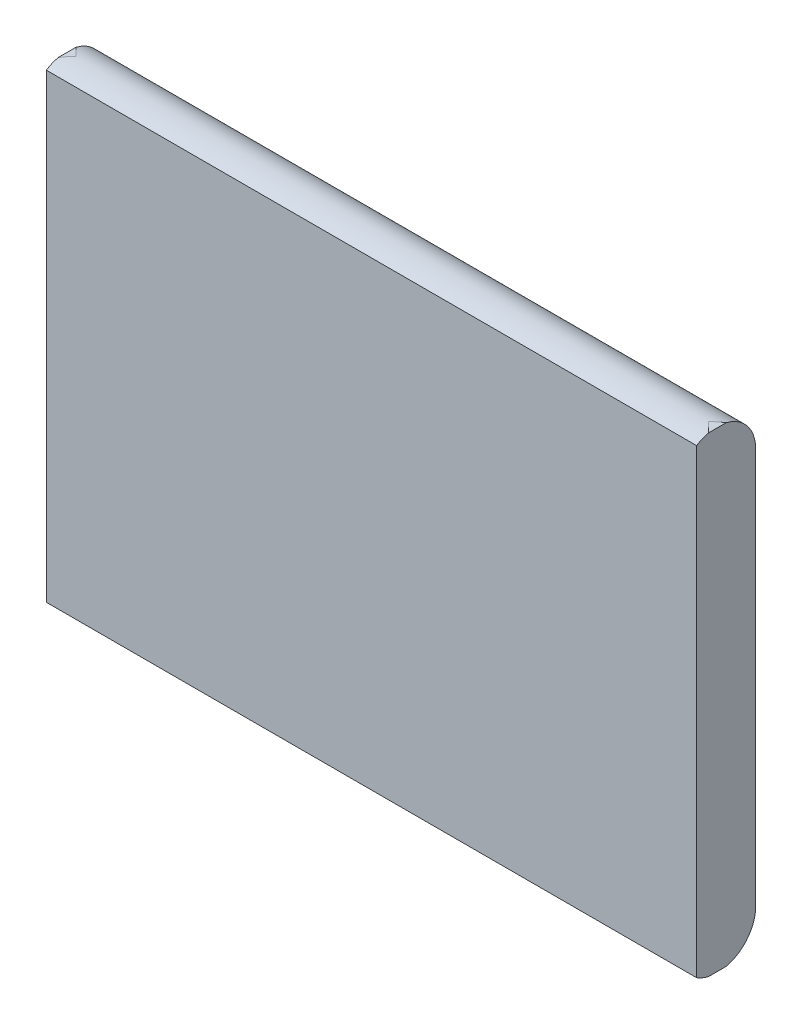
ISO-10303-21;
HEADER;
FILE_DESCRIPTION(('STEP AP214'),'2;1');
FILE_NAME('part.step','',(''),(''),'','','');
FILE_SCHEMA(('AUTOMOTIVE_DESIGN { 1 0 10303 214 1 1 1 1 }'));
ENDSEC;
DATA;
#1=APPLICATION_CONTEXT('core data for automotive mechanical design processes');
#2=APPLICATION_PROTOCOL_DEFINITION('international standard','automotive_design',2000,#1);
#3=PRODUCT_CONTEXT('',#1,'mechanical');
#4=PRODUCT('Part','Part','',(#3));
#5=PRODUCT_RELATED_PRODUCT_CATEGORY('part','',(#4));
#6=PRODUCT_DEFINITION_FORMATION('','',#4);
#7=PRODUCT_DEFINITION_CONTEXT('part definition',#1,'design');
#8=PRODUCT_DEFINITION('design','',#6,#7);
#9=PRODUCT_DEFINITION_SHAPE('','',#8);
#10=(LENGTH_UNIT() NAMED_UNIT(*) SI_UNIT(.MILLI.,.METRE.));
#11=(NAMED_UNIT(*) PLANE_ANGLE_UNIT() SI_UNIT($,.RADIAN.));
#12=(NAMED_UNIT(*) SI_UNIT($,.STERADIAN.) SOLID_ANGLE_UNIT());
#13=UNCERTAINTY_MEASURE_WITH_UNIT(LENGTH_MEASURE(1.E-05),#10,'distance_accuracy_value','');
#14=(GEOMETRIC_REPRESENTATION_CONTEXT(3) GLOBAL_UNCERTAINTY_ASSIGNED_CONTEXT((#13)) GLOBAL_UNIT_ASSIGNED_CONTEXT((#10,
#11,#12)) REPRESENTATION_CONTEXT('',''));
#15=CARTESIAN_POINT('',(0.,0.,0.));
#16=DIRECTION('',(0.,0.,1.));
#17=DIRECTION('',(1.,0.,0.));
#18=AXIS2_PLACEMENT_3D('',#15,#16,#17);
#19=CARTESIAN_POINT('',(-15.,-16.75,3.25));
#20=DIRECTION('',(1.,0.,0.));
#21=DIRECTION('',(0.,0.,-1.));
#22=AXIS2_PLACEMENT_3D('',#19,#20,#21);
#23=CYLINDRICAL_SURFACE('',#22,3.25);
#24=DIRECTION('',(1.,0.,0.));
#25=VECTOR('',#24,1.);
#26=CARTESIAN_POINT('',(-15.,-19.4886127875258,5.));
#27=LINE('',#26,#25);
#28=CARTESIAN_POINT('',(27.5,-19.4886127875258,5.));
#29=VERTEX_POINT('',#28);
#30=CARTESIAN_POINT('',(-27.5,-19.4886127875258,5.));
#31=VERTEX_POINT('',#30);
#32=EDGE_CURVE('E162',#29,#31,#27,.F.);
#33=ORIENTED_EDGE('',*,*,#32,.T.);
#34=CARTESIAN_POINT('',(-27.5,-16.75,3.25));
#35=DIRECTION('',(-1.,0.,0.));
#36=DIRECTION('',(0.,0.,1.));
#37=AXIS2_PLACEMENT_3D('',#34,#35,#36);
#38=CIRCLE('',#37,3.25);
#39=CARTESIAN_POINT('',(-27.5,-19.9122776601684,4.));
#40=VERTEX_POINT('',#39);
#41=EDGE_CURVE('E206',#31,#40,#38,.F.);
#42=ORIENTED_EDGE('',*,*,#41,.T.);
#43=CARTESIAN_POINT('',(-26.75,-16.75,3.25));
#44=DIRECTION('',(0.707106781186547,0.,0.707106781186547));
#45=DIRECTION('',(0.707106781186547,0.,-0.707106781186547));
#46=AXIS2_PLACEMENT_3D('',#43,#44,#45);
#47=ELLIPSE('',#46,4.59619407771256,3.25);
#48=CARTESIAN_POINT('',(-26.75,-20.,3.25));
#49=VERTEX_POINT('',#48);
#50=EDGE_CURVE('E155',#40,#49,#47,.T.);
#51=ORIENTED_EDGE('',*,*,#50,.T.);
#52=CARTESIAN_POINT('',(-26.75,-16.75,3.25));
#53=DIRECTION('',(0.707106781186547,0.,-0.707106781186547));
#54=DIRECTION('',(0.707106781186547,0.,0.707106781186547));
#55=AXIS2_PLACEMENT_3D('',#52,#53,#54);
#56=ELLIPSE('',#55,4.59619407771256,3.25);
#57=CARTESIAN_POINT('',(-27.5,-19.9122776601684,2.5));
#58=VERTEX_POINT('',#57);
#59=EDGE_CURVE('E151',#49,#58,#56,.T.);
#60=ORIENTED_EDGE('',*,*,#59,.T.);
#61=CARTESIAN_POINT('',(-27.5,-16.75,0.));
#62=VERTEX_POINT('',#61);
#63=EDGE_CURVE('E207',#58,#62,#38,.F.);
#64=ORIENTED_EDGE('',*,*,#63,.T.);
#65=DIRECTION('',(1.,0.,0.));
#66=VECTOR('',#65,1.);
#67=CARTESIAN_POINT('',(0.,-16.75,0.));
#68=LINE('',#67,#66);
#69=CARTESIAN_POINT('',(27.5,-16.75,0.));
#70=VERTEX_POINT('',#69);
#71=EDGE_CURVE('E133',#62,#70,#68,.T.);
#72=ORIENTED_EDGE('',*,*,#71,.T.);
#73=CARTESIAN_POINT('',(27.5,-16.75,3.25));
#74=DIRECTION('',(1.,0.,0.));
#75=DIRECTION('',(0.,0.,-1.));
#76=AXIS2_PLACEMENT_3D('',#73,#74,#75);
#77=CIRCLE('',#76,3.25);
#78=CARTESIAN_POINT('',(27.5,-19.9122776601684,2.5));
#79=VERTEX_POINT('',#78);
#80=EDGE_CURVE('E183',#70,#79,#77,.F.);
#81=ORIENTED_EDGE('',*,*,#80,.T.);
#82=CARTESIAN_POINT('',(26.75,-16.75,3.25));
#83=DIRECTION('',(0.707106781186547,0.,0.707106781186547));
#84=DIRECTION('',(0.707106781186547,0.,-0.707106781186547));
#85=AXIS2_PLACEMENT_3D('',#82,#83,#84);
#86=ELLIPSE('',#85,4.59619407771256,3.25);
#87=CARTESIAN_POINT('',(26.75,-20.,3.25));
#88=VERTEX_POINT('',#87);
#89=EDGE_CURVE('E148',#79,#88,#86,.F.);
#90=ORIENTED_EDGE('',*,*,#89,.T.);
#91=CARTESIAN_POINT('',(26.75,-16.75,3.25));
#92=DIRECTION('',(0.707106781186547,0.,-0.707106781186547));
#93=DIRECTION('',(0.707106781186547,0.,0.707106781186547));
#94=AXIS2_PLACEMENT_3D('',#91,#92,#93);
#95=ELLIPSE('',#94,4.59619407771256,3.25);
#96=CARTESIAN_POINT('',(27.5,-19.9122776601684,4.));
#97=VERTEX_POINT('',#96);
#98=EDGE_CURVE('E158',#88,#97,#95,.F.);
#99=ORIENTED_EDGE('',*,*,#98,.T.);
#100=EDGE_CURVE('E174',#97,#29,#77,.F.);
#101=ORIENTED_EDGE('',*,*,#100,.T.);
#102=EDGE_LOOP('',(#33,#42,#51,#60,#64,#72,#81,#90,#99,#101));
#103=FACE_BOUND('',#102,.T.);
#104=ADVANCED_FACE('F38',(#103),#23,.T.);
#105=CARTESIAN_POINT('',(15.,16.75,3.25));
#106=DIRECTION('',(-1.,0.,0.));
#107=DIRECTION('',(0.,0.,1.));
#108=AXIS2_PLACEMENT_3D('',#105,#106,#107);
#109=CYLINDRICAL_SURFACE('',#108,3.25);
#110=DIRECTION('',(1.,0.,0.));
#111=VECTOR('',#110,1.);
#112=CARTESIAN_POINT('',(0.,16.75,0.));
#113=LINE('',#112,#111);
#114=CARTESIAN_POINT('',(27.5,16.75,0.));
#115=VERTEX_POINT('',#114);
#116=CARTESIAN_POINT('',(-27.5,16.75,0.));
#117=VERTEX_POINT('',#116);
#118=EDGE_CURVE('E126',#115,#117,#113,.F.);
#119=ORIENTED_EDGE('',*,*,#118,.T.);
#120=CARTESIAN_POINT('',(-27.5,16.75,3.25));
#121=DIRECTION('',(-1.,0.,0.));
#122=DIRECTION('',(0.,0.,1.));
#123=AXIS2_PLACEMENT_3D('',#120,#121,#122);
#124=CIRCLE('',#123,3.25);
#125=CARTESIAN_POINT('',(-27.5,19.9122776601684,2.5));
#126=VERTEX_POINT('',#125);
#127=EDGE_CURVE('E115',#117,#126,#124,.F.);
#128=ORIENTED_EDGE('',*,*,#127,.T.);
#129=CARTESIAN_POINT('',(-26.75,16.75,3.25));
#130=DIRECTION('',(-0.707106781186547,0.,0.707106781186547));
#131=DIRECTION('',(-0.707106781186547,0.,-0.707106781186547));
#132=AXIS2_PLACEMENT_3D('',#129,#130,#131);
#133=ELLIPSE('',#132,4.59619407771256,3.25);
#134=CARTESIAN_POINT('',(-26.75,20.,3.25));
#135=VERTEX_POINT('',#134);
#136=EDGE_CURVE('E123',#126,#135,#133,.F.);
#137=ORIENTED_EDGE('',*,*,#136,.T.);
#138=CARTESIAN_POINT('',(-26.75,16.75,3.25));
#139=DIRECTION('',(-0.707106781186547,0.,-0.707106781186547));
#140=DIRECTION('',(-0.707106781186547,0.,0.707106781186547));
#141=AXIS2_PLACEMENT_3D('',#138,#139,#140);
#142=ELLIPSE('',#141,4.59619407771256,3.25);
#143=CARTESIAN_POINT('',(-27.5,19.9122776601684,4.));
#144=VERTEX_POINT('',#143);
#145=EDGE_CURVE('E131',#135,#144,#142,.F.);
#146=ORIENTED_EDGE('',*,*,#145,.T.);
#147=CARTESIAN_POINT('',(-27.5,19.4886127875258,5.));
#148=VERTEX_POINT('',#147);
#149=EDGE_CURVE('E54',#144,#148,#124,.F.);
#150=ORIENTED_EDGE('',*,*,#149,.T.);
#151=DIRECTION('',(-1.,0.,0.));
#152=VECTOR('',#151,1.);
#153=CARTESIAN_POINT('',(15.,19.4886127875258,5.));
#154=LINE('',#153,#152);
#155=CARTESIAN_POINT('',(27.5,19.4886127875258,5.));
#156=VERTEX_POINT('',#155);
#157=EDGE_CURVE('E60',#148,#156,#154,.F.);
#158=ORIENTED_EDGE('',*,*,#157,.T.);
#159=CARTESIAN_POINT('',(27.5,16.75,3.25));
#160=DIRECTION('',(1.,0.,0.));
#161=DIRECTION('',(0.,0.,-1.));
#162=AXIS2_PLACEMENT_3D('',#159,#160,#161);
#163=CIRCLE('',#162,3.25);
#164=CARTESIAN_POINT('',(27.5,19.9122776601684,4.));
#165=VERTEX_POINT('',#164);
#166=EDGE_CURVE('E176',#156,#165,#163,.F.);
#167=ORIENTED_EDGE('',*,*,#166,.T.);
#168=CARTESIAN_POINT('',(26.75,16.75,3.25));
#169=DIRECTION('',(-0.707106781186547,0.,0.707106781186547));
#170=DIRECTION('',(-0.707106781186547,0.,-0.707106781186547));
#171=AXIS2_PLACEMENT_3D('',#168,#169,#170);
#172=ELLIPSE('',#171,4.59619407771256,3.25);
#173=CARTESIAN_POINT('',(26.75,20.,3.25));
#174=VERTEX_POINT('',#173);
#175=EDGE_CURVE('E140',#165,#174,#172,.T.);
#176=ORIENTED_EDGE('',*,*,#175,.T.);
#177=CARTESIAN_POINT('',(26.75,16.75,3.25));
#178=DIRECTION('',(-0.707106781186547,0.,-0.707106781186547));
#179=DIRECTION('',(-0.707106781186547,0.,0.707106781186547));
#180=AXIS2_PLACEMENT_3D('',#177,#178,#179);
#181=ELLIPSE('',#180,4.59619407771256,3.25);
#182=CARTESIAN_POINT('',(27.5,19.9122776601684,2.5));
#183=VERTEX_POINT('',#182);
#184=EDGE_CURVE('E134',#174,#183,#181,.T.);
#185=ORIENTED_EDGE('',*,*,#184,.T.);
#186=EDGE_CURVE('E191',#183,#115,#163,.F.);
#187=ORIENTED_EDGE('',*,*,#186,.T.);
#188=EDGE_LOOP('',(#119,#128,#137,#146,#150,#158,#167,#176,#185,#187));
#189=FACE_BOUND('',#188,.T.);
#190=ADVANCED_FACE('F122',(#189),#109,.T.);
#191=CARTESIAN_POINT('',(0.,0.,0.));
#192=DIRECTION('',(0.,0.,1.));
#193=DIRECTION('',(1.,0.,0.));
#194=AXIS2_PLACEMENT_3D('',#191,#192,#193);
#195=PLANE('',#194);
#196=DIRECTION('',(0.,-1.,0.));
#197=VECTOR('',#196,1.);
#198=CARTESIAN_POINT('',(-27.5,0.,0.));
#199=LINE('',#198,#197);
#200=EDGE_CURVE('E211',#117,#62,#199,.T.);
#201=ORIENTED_EDGE('',*,*,#200,.F.);
#202=ORIENTED_EDGE('',*,*,#118,.F.);
#203=DIRECTION('',(0.,1.,0.));
#204=VECTOR('',#203,1.);
#205=CARTESIAN_POINT('',(27.5,0.,0.));
#206=LINE('',#205,#204);
#207=EDGE_CURVE('E194',#70,#115,#206,.T.);
#208=ORIENTED_EDGE('',*,*,#207,.F.);
#209=ORIENTED_EDGE('',*,*,#71,.F.);
#210=EDGE_LOOP('',(#201,#202,#208,#209));
#211=FACE_BOUND('',#210,.T.);
#212=ADVANCED_FACE('F223',(#211),#195,.F.);
#213=CARTESIAN_POINT('',(0.,0.,5.));
#214=DIRECTION('',(0.,0.,1.));
#215=DIRECTION('',(1.,0.,0.));
#216=AXIS2_PLACEMENT_3D('',#213,#214,#215);
#217=PLANE('',#216);
#218=ORIENTED_EDGE('',*,*,#157,.F.);
#219=DIRECTION('',(0.,-1.,0.));
#220=VECTOR('',#219,1.);
#221=CARTESIAN_POINT('',(-27.5,0.,5.));
#222=LINE('',#221,#220);
#223=EDGE_CURVE('E128',#148,#31,#222,.T.);
#224=ORIENTED_EDGE('',*,*,#223,.T.);
#225=ORIENTED_EDGE('',*,*,#32,.F.);
#226=DIRECTION('',(0.,1.,0.));
#227=VECTOR('',#226,1.);
#228=CARTESIAN_POINT('',(27.5,0.,5.));
#229=LINE('',#228,#227);
#230=EDGE_CURVE('E47',#29,#156,#229,.T.);
#231=ORIENTED_EDGE('',*,*,#230,.T.);
#232=EDGE_LOOP('',(#218,#224,#225,#231));
#233=FACE_BOUND('',#232,.T.);
#234=ADVANCED_FACE('F168',(#233),#217,.T.);
#235=CARTESIAN_POINT('',(-26.75,-16.75,0.));
#236=DIRECTION('',(0.,0.,1.));
#237=DIRECTION('',(1.,0.,0.));
#238=AXIS2_PLACEMENT_3D('',#235,#236,#237);
#239=CYLINDRICAL_SURFACE('',#238,3.25);
#240=ORIENTED_EDGE('',*,*,#50,.F.);
#241=DIRECTION('',(0.,0.,1.));
#242=VECTOR('',#241,1.);
#243=CARTESIAN_POINT('',(-27.5,-19.9122776601684,0.));
#244=LINE('',#243,#242);
#245=EDGE_CURVE('E189',#40,#58,#244,.F.);
#246=ORIENTED_EDGE('',*,*,#245,.T.);
#247=ORIENTED_EDGE('',*,*,#59,.F.);
#248=EDGE_LOOP('',(#240,#246,#247));
#249=FACE_BOUND('',#248,.T.);
#250=ADVANCED_FACE('F40',(#249),#239,.T.);
#251=CARTESIAN_POINT('',(-26.75,16.75,0.));
#252=DIRECTION('',(0.,0.,1.));
#253=DIRECTION('',(1.,0.,0.));
#254=AXIS2_PLACEMENT_3D('',#251,#252,#253);
#255=CYLINDRICAL_SURFACE('',#254,3.25);
#256=ORIENTED_EDGE('',*,*,#136,.F.);
#257=DIRECTION('',(0.,0.,1.));
#258=VECTOR('',#257,1.);
#259=CARTESIAN_POINT('',(-27.5,19.9122776601684,0.));
#260=LINE('',#259,#258);
#261=EDGE_CURVE('E11',#126,#144,#260,.T.);
#262=ORIENTED_EDGE('',*,*,#261,.T.);
#263=ORIENTED_EDGE('',*,*,#145,.F.);
#264=EDGE_LOOP('',(#256,#262,#263));
#265=FACE_BOUND('',#264,.T.);
#266=ADVANCED_FACE('F130',(#265),#255,.T.);
#267=CARTESIAN_POINT('',(26.75,-16.75,0.));
#268=DIRECTION('',(0.,0.,1.));
#269=DIRECTION('',(1.,0.,0.));
#270=AXIS2_PLACEMENT_3D('',#267,#268,#269);
#271=CYLINDRICAL_SURFACE('',#270,3.25);
#272=ORIENTED_EDGE('',*,*,#89,.F.);
#273=DIRECTION('',(0.,0.,1.));
#274=VECTOR('',#273,1.);
#275=CARTESIAN_POINT('',(27.5,-19.9122776601684,0.));
#276=LINE('',#275,#274);
#277=EDGE_CURVE('E187',#79,#97,#276,.T.);
#278=ORIENTED_EDGE('',*,*,#277,.T.);
#279=ORIENTED_EDGE('',*,*,#98,.F.);
#280=EDGE_LOOP('',(#272,#278,#279));
#281=FACE_BOUND('',#280,.T.);
#282=ADVANCED_FACE('F225',(#281),#271,.T.);
#283=CARTESIAN_POINT('',(26.75,16.75,0.));
#284=DIRECTION('',(0.,0.,1.));
#285=DIRECTION('',(1.,0.,0.));
#286=AXIS2_PLACEMENT_3D('',#283,#284,#285);
#287=CYLINDRICAL_SURFACE('',#286,3.25);
#288=ORIENTED_EDGE('',*,*,#175,.F.);
#289=DIRECTION('',(0.,0.,1.));
#290=VECTOR('',#289,1.);
#291=CARTESIAN_POINT('',(27.5,19.9122776601684,0.));
#292=LINE('',#291,#290);
#293=EDGE_CURVE('E181',#165,#183,#292,.F.);
#294=ORIENTED_EDGE('',*,*,#293,.T.);
#295=ORIENTED_EDGE('',*,*,#184,.F.);
#296=EDGE_LOOP('',(#288,#294,#295));
#297=FACE_BOUND('',#296,.T.);
#298=ADVANCED_FACE('F227',(#297),#287,.T.);
#299=CARTESIAN_POINT('',(27.5,0.,0.));
#300=DIRECTION('',(1.,0.,0.));
#301=DIRECTION('',(0.,0.,-1.));
#302=AXIS2_PLACEMENT_3D('',#299,#300,#301);
#303=PLANE('',#302);
#304=ORIENTED_EDGE('',*,*,#207,.T.);
#305=ORIENTED_EDGE('',*,*,#186,.F.);
#306=ORIENTED_EDGE('',*,*,#293,.F.);
#307=ORIENTED_EDGE('',*,*,#166,.F.);
#308=ORIENTED_EDGE('',*,*,#230,.F.);
#309=ORIENTED_EDGE('',*,*,#100,.F.);
#310=ORIENTED_EDGE('',*,*,#277,.F.);
#311=ORIENTED_EDGE('',*,*,#80,.F.);
#312=EDGE_LOOP('',(#304,#305,#306,#307,#308,#309,#310,#311));
#313=FACE_BOUND('',#312,.T.);
#314=ADVANCED_FACE('F173',(#313),#303,.T.);
#315=CARTESIAN_POINT('',(-27.5,0.,0.));
#316=DIRECTION('',(-1.,0.,0.));
#317=DIRECTION('',(0.,0.,1.));
#318=AXIS2_PLACEMENT_3D('',#315,#316,#317);
#319=PLANE('',#318);
#320=ORIENTED_EDGE('',*,*,#41,.F.);
#321=ORIENTED_EDGE('',*,*,#223,.F.);
#322=ORIENTED_EDGE('',*,*,#149,.F.);
#323=ORIENTED_EDGE('',*,*,#261,.F.);
#324=ORIENTED_EDGE('',*,*,#127,.F.);
#325=ORIENTED_EDGE('',*,*,#200,.T.);
#326=ORIENTED_EDGE('',*,*,#63,.F.);
#327=ORIENTED_EDGE('',*,*,#245,.F.);
#328=EDGE_LOOP('',(#320,#321,#322,#323,#324,#325,#326,#327));
#329=FACE_BOUND('',#328,.T.);
#330=ADVANCED_FACE('F114',(#329),#319,.T.);
#331=CLOSED_SHELL('',(#104,#190,#212,#234,#250,#266,#282,#298,#314,#330));
#332=MANIFOLD_SOLID_BREP('B2',#331);
#333=ADVANCED_BREP_SHAPE_REPRESENTATION('',(#18,#332),#14);
#334=SHAPE_DEFINITION_REPRESENTATION(#9,#333);
ENDSEC;
END-ISO-10303-21;
